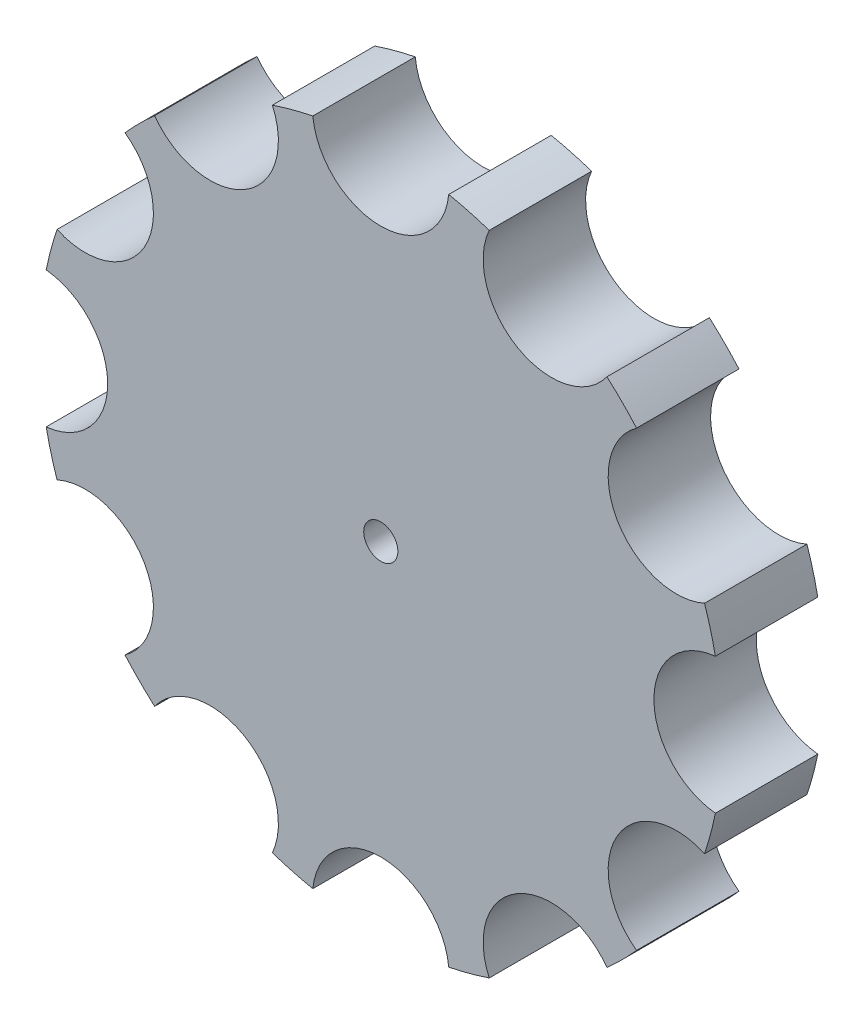
ISO-10303-21;
HEADER;
FILE_DESCRIPTION(('STEP AP214'),'2;1');
FILE_NAME('part.step','',(''),(''),'','','');
FILE_SCHEMA(('AUTOMOTIVE_DESIGN { 1 0 10303 214 1 1 1 1 }'));
ENDSEC;
DATA;
#1=APPLICATION_CONTEXT('core data for automotive mechanical design processes');
#2=APPLICATION_PROTOCOL_DEFINITION('international standard','automotive_design',2000,#1);
#3=PRODUCT_CONTEXT('',#1,'mechanical');
#4=PRODUCT('Part','Part','',(#3));
#5=PRODUCT_RELATED_PRODUCT_CATEGORY('part','',(#4));
#6=PRODUCT_DEFINITION_FORMATION('','',#4);
#7=PRODUCT_DEFINITION_CONTEXT('part definition',#1,'design');
#8=PRODUCT_DEFINITION('design','',#6,#7);
#9=PRODUCT_DEFINITION_SHAPE('','',#8);
#10=(LENGTH_UNIT() NAMED_UNIT(*) SI_UNIT(.MILLI.,.METRE.));
#11=(NAMED_UNIT(*) PLANE_ANGLE_UNIT() SI_UNIT($,.RADIAN.));
#12=(NAMED_UNIT(*) SI_UNIT($,.STERADIAN.) SOLID_ANGLE_UNIT());
#13=UNCERTAINTY_MEASURE_WITH_UNIT(LENGTH_MEASURE(1.E-05),#10,'distance_accuracy_value','');
#14=(GEOMETRIC_REPRESENTATION_CONTEXT(3) GLOBAL_UNCERTAINTY_ASSIGNED_CONTEXT((#13)) GLOBAL_UNIT_ASSIGNED_CONTEXT((#10,
#11,#12)) REPRESENTATION_CONTEXT('',''));
#15=CARTESIAN_POINT('',(0.,0.,0.));
#16=DIRECTION('',(0.,0.,1.));
#17=DIRECTION('',(1.,0.,0.));
#18=AXIS2_PLACEMENT_3D('',#15,#16,#17);
#19=CARTESIAN_POINT('',(-24.9999999999997,43.3012701892209,15.));
#20=DIRECTION('',(0.,0.,-1.));
#21=DIRECTION('',(-1.,0.,0.));
#22=AXIS2_PLACEMENT_3D('',#19,#20,#21);
#23=CYLINDRICAL_SURFACE('',#22,10.0034017647237);
#24=CARTESIAN_POINT('',(-24.9999999999997,43.3012701892209,0.));
#25=DIRECTION('',(0.,0.,1.));
#26=DIRECTION('',(1.,0.,0.));
#27=AXIS2_PLACEMENT_3D('',#24,#25,#26);
#28=CIRCLE('',#27,10.0034017647237);
#29=CARTESIAN_POINT('',(-33.1194053593373,37.4580430434359,0.));
#30=VERTEX_POINT('',#29);
#31=CARTESIAN_POINT('',(-15.8799141719984,47.4112679211384,0.));
#32=VERTEX_POINT('',#31);
#33=EDGE_CURVE('E239',#30,#32,#28,.T.);
#34=ORIENTED_EDGE('',*,*,#33,.F.);
#35=DIRECTION('',(0.,0.,-1.));
#36=VECTOR('',#35,1.);
#37=CARTESIAN_POINT('',(-33.1194053593373,37.4580430434359,15.));
#38=LINE('',#37,#36);
#39=CARTESIAN_POINT('',(-33.1194053593373,37.4580430434359,15.));
#40=VERTEX_POINT('',#39);
#41=EDGE_CURVE('E11',#40,#30,#38,.T.);
#42=ORIENTED_EDGE('',*,*,#41,.F.);
#43=CARTESIAN_POINT('',(-24.9999999999997,43.3012701892209,15.));
#44=DIRECTION('',(0.,0.,1.));
#45=DIRECTION('',(1.,0.,0.));
#46=AXIS2_PLACEMENT_3D('',#43,#44,#45);
#47=CIRCLE('',#46,10.0034017647237);
#48=CARTESIAN_POINT('',(-15.8799141719984,47.4112679211384,15.));
#49=VERTEX_POINT('',#48);
#50=EDGE_CURVE('E332',#40,#49,#47,.T.);
#51=ORIENTED_EDGE('',*,*,#50,.T.);
#52=DIRECTION('',(0.,0.,-1.));
#53=VECTOR('',#52,1.);
#54=CARTESIAN_POINT('',(-15.8799141719984,47.4112679211384,15.));
#55=LINE('',#54,#53);
#56=EDGE_CURVE('E144',#49,#32,#55,.T.);
#57=ORIENTED_EDGE('',*,*,#56,.T.);
#58=EDGE_LOOP('',(#34,#42,#51,#57));
#59=FACE_BOUND('',#58,.T.);
#60=ADVANCED_FACE('F45',(#59),#23,.F.);
#61=CARTESIAN_POINT('',(0.,0.,15.));
#62=DIRECTION('',(0.,0.,-1.));
#63=DIRECTION('',(-1.,0.,0.));
#64=AXIS2_PLACEMENT_3D('',#61,#62,#63);
#65=CYLINDRICAL_SURFACE('',#64,50.);
#66=CARTESIAN_POINT('',(0.,0.,0.));
#67=DIRECTION('',(0.,0.,1.));
#68=DIRECTION('',(1.,0.,0.));
#69=AXIS2_PLACEMENT_3D('',#66,#67,#68);
#70=CIRCLE('',#69,50.);
#71=CARTESIAN_POINT('',(-37.4580430434362,33.119405359337,0.));
#72=VERTEX_POINT('',#71);
#73=EDGE_CURVE('E243',#30,#72,#70,.T.);
#74=ORIENTED_EDGE('',*,*,#73,.T.);
#75=DIRECTION('',(0.,0.,-1.));
#76=VECTOR('',#75,1.);
#77=CARTESIAN_POINT('',(-37.4580430434362,33.119405359337,15.));
#78=LINE('',#77,#76);
#79=CARTESIAN_POINT('',(-37.4580430434362,33.119405359337,15.));
#80=VERTEX_POINT('',#79);
#81=EDGE_CURVE('E54',#80,#72,#78,.T.);
#82=ORIENTED_EDGE('',*,*,#81,.F.);
#83=CARTESIAN_POINT('',(0.,0.,15.));
#84=DIRECTION('',(0.,0.,1.));
#85=DIRECTION('',(1.,0.,0.));
#86=AXIS2_PLACEMENT_3D('',#83,#84,#85);
#87=CIRCLE('',#86,50.);
#88=EDGE_CURVE('E418',#40,#80,#87,.T.);
#89=ORIENTED_EDGE('',*,*,#88,.F.);
#90=ORIENTED_EDGE('',*,*,#41,.T.);
#91=EDGE_LOOP('',(#74,#82,#89,#90));
#92=FACE_BOUND('',#91,.T.);
#93=ADVANCED_FACE('F402',(#92),#65,.T.);
#94=CARTESIAN_POINT('',(-43.3012701892209,24.9999999999981,15.));
#95=DIRECTION('',(0.,0.,-1.));
#96=DIRECTION('',(-1.,0.,0.));
#97=AXIS2_PLACEMENT_3D('',#94,#95,#96);
#98=CYLINDRICAL_SURFACE('',#97,10.0034017647246);
#99=CARTESIAN_POINT('',(-43.3012701892209,24.9999999999981,0.));
#100=DIRECTION('',(0.,0.,1.));
#101=DIRECTION('',(1.,0.,0.));
#102=AXIS2_PLACEMENT_3D('',#99,#100,#101);
#103=CIRCLE('',#102,10.0034017647246);
#104=CARTESIAN_POINT('',(-47.4112679211391,15.8799141719961,0.));
#105=VERTEX_POINT('',#104);
#106=EDGE_CURVE('E248',#105,#72,#103,.T.);
#107=ORIENTED_EDGE('',*,*,#106,.F.);
#108=DIRECTION('',(0.,0.,-1.));
#109=VECTOR('',#108,1.);
#110=CARTESIAN_POINT('',(-47.4112679211391,15.8799141719961,15.));
#111=LINE('',#110,#109);
#112=CARTESIAN_POINT('',(-47.4112679211391,15.8799141719961,15.));
#113=VERTEX_POINT('',#112);
#114=EDGE_CURVE('E390',#113,#105,#111,.T.);
#115=ORIENTED_EDGE('',*,*,#114,.F.);
#116=CARTESIAN_POINT('',(-43.3012701892209,24.9999999999981,15.));
#117=DIRECTION('',(0.,0.,1.));
#118=DIRECTION('',(1.,0.,0.));
#119=AXIS2_PLACEMENT_3D('',#116,#117,#118);
#120=CIRCLE('',#119,10.0034017647246);
#121=EDGE_CURVE('E399',#113,#80,#120,.T.);
#122=ORIENTED_EDGE('',*,*,#121,.T.);
#123=ORIENTED_EDGE('',*,*,#81,.T.);
#124=EDGE_LOOP('',(#107,#115,#122,#123));
#125=FACE_BOUND('',#124,.T.);
#126=ADVANCED_FACE('F397',(#125),#98,.F.);
#127=CARTESIAN_POINT('',(0.,0.,15.));
#128=DIRECTION('',(0.,0.,-1.));
#129=DIRECTION('',(-1.,0.,0.));
#130=AXIS2_PLACEMENT_3D('',#127,#128,#129);
#131=CYLINDRICAL_SURFACE('',#130,50.);
#132=CARTESIAN_POINT('',(0.,0.,0.));
#133=DIRECTION('',(0.,0.,1.));
#134=DIRECTION('',(1.,0.,0.));
#135=AXIS2_PLACEMENT_3D('',#132,#133,#134);
#136=CIRCLE('',#135,50.);
#137=CARTESIAN_POINT('',(-48.9993195313352,9.95322487770228,0.));
#138=VERTEX_POINT('',#137);
#139=EDGE_CURVE('E252',#105,#138,#136,.T.);
#140=ORIENTED_EDGE('',*,*,#139,.T.);
#141=DIRECTION('',(0.,0.,-1.));
#142=VECTOR('',#141,1.);
#143=CARTESIAN_POINT('',(-48.9993195313352,9.95322487770228,15.));
#144=LINE('',#143,#142);
#145=CARTESIAN_POINT('',(-48.9993195313352,9.95322487770228,15.));
#146=VERTEX_POINT('',#145);
#147=EDGE_CURVE('E387',#146,#138,#144,.T.);
#148=ORIENTED_EDGE('',*,*,#147,.F.);
#149=CARTESIAN_POINT('',(0.,0.,15.));
#150=DIRECTION('',(0.,0.,1.));
#151=DIRECTION('',(1.,0.,0.));
#152=AXIS2_PLACEMENT_3D('',#149,#150,#151);
#153=CIRCLE('',#152,50.);
#154=EDGE_CURVE('E413',#113,#146,#153,.T.);
#155=ORIENTED_EDGE('',*,*,#154,.F.);
#156=ORIENTED_EDGE('',*,*,#114,.T.);
#157=EDGE_LOOP('',(#140,#148,#155,#156));
#158=FACE_BOUND('',#157,.T.);
#159=ADVANCED_FACE('F410',(#158),#131,.T.);
#160=CARTESIAN_POINT('',(-49.9999999999979,-2.12856659028243E-12,15.));
#161=DIRECTION('',(0.,0.,-1.));
#162=DIRECTION('',(-1.,0.,0.));
#163=AXIS2_PLACEMENT_3D('',#160,#161,#162);
#164=CYLINDRICAL_SURFACE('',#163,10.0034017647256);
#165=CARTESIAN_POINT('',(-49.9999999999979,-2.12856659028243E-12,0.));
#166=DIRECTION('',(0.,0.,1.));
#167=DIRECTION('',(1.,0.,0.));
#168=AXIS2_PLACEMENT_3D('',#165,#166,#167);
#169=CIRCLE('',#168,10.0034017647256);
#170=CARTESIAN_POINT('',(-48.9993195313344,-9.95322487770645,0.));
#171=VERTEX_POINT('',#170);
#172=EDGE_CURVE('E256',#171,#138,#169,.T.);
#173=ORIENTED_EDGE('',*,*,#172,.F.);
#174=DIRECTION('',(0.,0.,-1.));
#175=VECTOR('',#174,1.);
#176=CARTESIAN_POINT('',(-48.9993195313344,-9.95322487770645,15.));
#177=LINE('',#176,#175);
#178=CARTESIAN_POINT('',(-48.9993195313344,-9.95322487770645,15.));
#179=VERTEX_POINT('',#178);
#180=EDGE_CURVE('E384',#179,#171,#177,.T.);
#181=ORIENTED_EDGE('',*,*,#180,.F.);
#182=CARTESIAN_POINT('',(-49.9999999999979,-2.12856659028243E-12,15.));
#183=DIRECTION('',(0.,0.,1.));
#184=DIRECTION('',(1.,0.,0.));
#185=AXIS2_PLACEMENT_3D('',#182,#183,#184);
#186=CIRCLE('',#185,10.0034017647256);
#187=EDGE_CURVE('E416',#179,#146,#186,.T.);
#188=ORIENTED_EDGE('',*,*,#187,.T.);
#189=ORIENTED_EDGE('',*,*,#147,.T.);
#190=EDGE_LOOP('',(#173,#181,#188,#189));
#191=FACE_BOUND('',#190,.T.);
#192=ADVANCED_FACE('F520',(#191),#164,.F.);
#193=CARTESIAN_POINT('',(0.,0.,15.));
#194=DIRECTION('',(0.,0.,-1.));
#195=DIRECTION('',(-1.,0.,0.));
#196=AXIS2_PLACEMENT_3D('',#193,#194,#195);
#197=CYLINDRICAL_SURFACE('',#196,50.);
#198=CARTESIAN_POINT('',(0.,0.,0.));
#199=DIRECTION('',(0.,0.,1.));
#200=DIRECTION('',(1.,0.,0.));
#201=AXIS2_PLACEMENT_3D('',#198,#199,#200);
#202=CIRCLE('',#201,50.);
#203=CARTESIAN_POINT('',(-47.4112679211384,-15.8799141719984,0.));
#204=VERTEX_POINT('',#203);
#205=EDGE_CURVE('E260',#171,#204,#202,.T.);
#206=ORIENTED_EDGE('',*,*,#205,.T.);
#207=DIRECTION('',(0.,0.,-1.));
#208=VECTOR('',#207,1.);
#209=CARTESIAN_POINT('',(-47.4112679211384,-15.8799141719984,15.));
#210=LINE('',#209,#208);
#211=CARTESIAN_POINT('',(-47.4112679211384,-15.8799141719984,15.));
#212=VERTEX_POINT('',#211);
#213=EDGE_CURVE('E381',#212,#204,#210,.T.);
#214=ORIENTED_EDGE('',*,*,#213,.F.);
#215=CARTESIAN_POINT('',(0.,0.,15.));
#216=DIRECTION('',(0.,0.,1.));
#217=DIRECTION('',(1.,0.,0.));
#218=AXIS2_PLACEMENT_3D('',#215,#216,#217);
#219=CIRCLE('',#218,50.);
#220=EDGE_CURVE('E427',#179,#212,#219,.T.);
#221=ORIENTED_EDGE('',*,*,#220,.F.);
#222=ORIENTED_EDGE('',*,*,#180,.T.);
#223=EDGE_LOOP('',(#206,#214,#221,#222));
#224=FACE_BOUND('',#223,.T.);
#225=ADVANCED_FACE('F523',(#224),#197,.T.);
#226=CARTESIAN_POINT('',(-43.3012701892187,-25.0000000000019,15.));
#227=DIRECTION('',(0.,0.,-1.));
#228=DIRECTION('',(-1.,0.,0.));
#229=AXIS2_PLACEMENT_3D('',#226,#227,#228);
#230=CYLINDRICAL_SURFACE('',#229,10.0034017647265);
#231=CARTESIAN_POINT('',(-43.3012701892187,-25.0000000000019,0.));
#232=DIRECTION('',(0.,0.,1.));
#233=DIRECTION('',(1.,0.,0.));
#234=AXIS2_PLACEMENT_3D('',#231,#232,#233);
#235=CIRCLE('',#234,10.0034017647265);
#236=CARTESIAN_POINT('',(-37.4580430434321,-33.1194053593416,0.));
#237=VERTEX_POINT('',#236);
#238=EDGE_CURVE('E264',#237,#204,#235,.T.);
#239=ORIENTED_EDGE('',*,*,#238,.F.);
#240=DIRECTION('',(0.,0.,-1.));
#241=VECTOR('',#240,1.);
#242=CARTESIAN_POINT('',(-37.4580430434321,-33.1194053593416,15.));
#243=LINE('',#242,#241);
#244=CARTESIAN_POINT('',(-37.4580430434321,-33.1194053593416,15.));
#245=VERTEX_POINT('',#244);
#246=EDGE_CURVE('E378',#245,#237,#243,.T.);
#247=ORIENTED_EDGE('',*,*,#246,.F.);
#248=CARTESIAN_POINT('',(-43.3012701892187,-25.0000000000019,15.));
#249=DIRECTION('',(0.,0.,1.));
#250=DIRECTION('',(1.,0.,0.));
#251=AXIS2_PLACEMENT_3D('',#248,#249,#250);
#252=CIRCLE('',#251,10.0034017647265);
#253=EDGE_CURVE('E430',#245,#212,#252,.T.);
#254=ORIENTED_EDGE('',*,*,#253,.T.);
#255=ORIENTED_EDGE('',*,*,#213,.T.);
#256=EDGE_LOOP('',(#239,#247,#254,#255));
#257=FACE_BOUND('',#256,.T.);
#258=ADVANCED_FACE('F527',(#257),#230,.F.);
#259=CARTESIAN_POINT('',(0.,0.,15.));
#260=DIRECTION('',(0.,0.,-1.));
#261=DIRECTION('',(-1.,0.,0.));
#262=AXIS2_PLACEMENT_3D('',#259,#260,#261);
#263=CYLINDRICAL_SURFACE('',#262,50.);
#264=CARTESIAN_POINT('',(0.,0.,0.));
#265=DIRECTION('',(0.,0.,1.));
#266=DIRECTION('',(1.,0.,0.));
#267=AXIS2_PLACEMENT_3D('',#264,#265,#266);
#268=CIRCLE('',#267,50.);
#269=CARTESIAN_POINT('',(-33.1194053593366,-37.4580430434366,0.));
#270=VERTEX_POINT('',#269);
#271=EDGE_CURVE('E268',#237,#270,#268,.T.);
#272=ORIENTED_EDGE('',*,*,#271,.T.);
#273=DIRECTION('',(0.,0.,-1.));
#274=VECTOR('',#273,1.);
#275=CARTESIAN_POINT('',(-33.1194053593366,-37.4580430434366,15.));
#276=LINE('',#275,#274);
#277=CARTESIAN_POINT('',(-33.1194053593366,-37.4580430434366,15.));
#278=VERTEX_POINT('',#277);
#279=EDGE_CURVE('E375',#278,#270,#276,.T.);
#280=ORIENTED_EDGE('',*,*,#279,.F.);
#281=CARTESIAN_POINT('',(0.,0.,15.));
#282=DIRECTION('',(0.,0.,1.));
#283=DIRECTION('',(1.,0.,0.));
#284=AXIS2_PLACEMENT_3D('',#281,#282,#283);
#285=CIRCLE('',#284,50.);
#286=EDGE_CURVE('E434',#245,#278,#285,.T.);
#287=ORIENTED_EDGE('',*,*,#286,.F.);
#288=ORIENTED_EDGE('',*,*,#246,.T.);
#289=EDGE_LOOP('',(#272,#280,#287,#288));
#290=FACE_BOUND('',#289,.T.);
#291=ADVANCED_FACE('F531',(#290),#263,.T.);
#292=CARTESIAN_POINT('',(-24.999999999996,-43.301270189223,15.));
#293=DIRECTION('',(0.,0.,-1.));
#294=DIRECTION('',(-1.,0.,0.));
#295=AXIS2_PLACEMENT_3D('',#292,#293,#294);
#296=CYLINDRICAL_SURFACE('',#295,10.003401764727);
#297=CARTESIAN_POINT('',(-24.999999999996,-43.301270189223,0.));
#298=DIRECTION('',(0.,0.,1.));
#299=DIRECTION('',(1.,0.,0.));
#300=AXIS2_PLACEMENT_3D('',#297,#298,#299);
#301=CIRCLE('',#300,10.003401764727);
#302=CARTESIAN_POINT('',(-15.8799141719912,-47.4112679211408,0.));
#303=VERTEX_POINT('',#302);
#304=EDGE_CURVE('E272',#303,#270,#301,.T.);
#305=ORIENTED_EDGE('',*,*,#304,.F.);
#306=DIRECTION('',(0.,0.,-1.));
#307=VECTOR('',#306,1.);
#308=CARTESIAN_POINT('',(-15.8799141719912,-47.4112679211408,15.));
#309=LINE('',#308,#307);
#310=CARTESIAN_POINT('',(-15.8799141719912,-47.4112679211408,15.));
#311=VERTEX_POINT('',#310);
#312=EDGE_CURVE('E372',#311,#303,#309,.T.);
#313=ORIENTED_EDGE('',*,*,#312,.F.);
#314=CARTESIAN_POINT('',(-24.999999999996,-43.301270189223,15.));
#315=DIRECTION('',(0.,0.,1.));
#316=DIRECTION('',(1.,0.,0.));
#317=AXIS2_PLACEMENT_3D('',#314,#315,#316);
#318=CIRCLE('',#317,10.003401764727);
#319=EDGE_CURVE('E437',#311,#278,#318,.T.);
#320=ORIENTED_EDGE('',*,*,#319,.T.);
#321=ORIENTED_EDGE('',*,*,#279,.T.);
#322=EDGE_LOOP('',(#305,#313,#320,#321));
#323=FACE_BOUND('',#322,.T.);
#324=ADVANCED_FACE('F535',(#323),#296,.F.);
#325=CARTESIAN_POINT('',(0.,0.,15.));
#326=DIRECTION('',(0.,0.,-1.));
#327=DIRECTION('',(-1.,0.,0.));
#328=AXIS2_PLACEMENT_3D('',#325,#326,#327);
#329=CYLINDRICAL_SURFACE('',#328,50.);
#330=CARTESIAN_POINT('',(0.,0.,0.));
#331=DIRECTION('',(0.,0.,1.));
#332=DIRECTION('',(1.,0.,0.));
#333=AXIS2_PLACEMENT_3D('',#330,#331,#332);
#334=CIRCLE('',#333,50.);
#335=CARTESIAN_POINT('',(-9.95322487770119,-48.9993195313354,0.));
#336=VERTEX_POINT('',#335);
#337=EDGE_CURVE('E276',#303,#336,#334,.T.);
#338=ORIENTED_EDGE('',*,*,#337,.T.);
#339=DIRECTION('',(0.,0.,-1.));
#340=VECTOR('',#339,1.);
#341=CARTESIAN_POINT('',(-9.95322487770119,-48.9993195313354,15.));
#342=LINE('',#341,#340);
#343=CARTESIAN_POINT('',(-9.95322487770119,-48.9993195313354,15.));
#344=VERTEX_POINT('',#343);
#345=EDGE_CURVE('E369',#344,#336,#342,.T.);
#346=ORIENTED_EDGE('',*,*,#345,.F.);
#347=CARTESIAN_POINT('',(0.,0.,15.));
#348=DIRECTION('',(0.,0.,1.));
#349=DIRECTION('',(1.,0.,0.));
#350=AXIS2_PLACEMENT_3D('',#347,#348,#349);
#351=CIRCLE('',#350,50.);
#352=EDGE_CURVE('E441',#311,#344,#351,.T.);
#353=ORIENTED_EDGE('',*,*,#352,.F.);
#354=ORIENTED_EDGE('',*,*,#312,.T.);
#355=EDGE_LOOP('',(#338,#346,#353,#354));
#356=FACE_BOUND('',#355,.T.);
#357=ADVANCED_FACE('F539',(#356),#329,.T.);
#358=CARTESIAN_POINT('',(4.24488671257339E-12,-50.,15.));
#359=DIRECTION('',(0.,0.,-1.));
#360=DIRECTION('',(-1.,0.,0.));
#361=AXIS2_PLACEMENT_3D('',#358,#359,#360);
#362=CYLINDRICAL_SURFACE('',#361,10.0034017647269);
#363=CARTESIAN_POINT('',(4.24488671257339E-12,-50.,0.));
#364=DIRECTION('',(0.,0.,1.));
#365=DIRECTION('',(1.,0.,0.));
#366=AXIS2_PLACEMENT_3D('',#363,#364,#365);
#367=CIRCLE('',#366,10.0034017647269);
#368=CARTESIAN_POINT('',(9.95322487770951,-48.9993195313337,0.));
#369=VERTEX_POINT('',#368);
#370=EDGE_CURVE('E280',#369,#336,#367,.T.);
#371=ORIENTED_EDGE('',*,*,#370,.F.);
#372=DIRECTION('',(0.,0.,-1.));
#373=VECTOR('',#372,1.);
#374=CARTESIAN_POINT('',(9.95322487770951,-48.9993195313337,15.));
#375=LINE('',#374,#373);
#376=CARTESIAN_POINT('',(9.95322487770951,-48.9993195313337,15.));
#377=VERTEX_POINT('',#376);
#378=EDGE_CURVE('E366',#377,#369,#375,.T.);
#379=ORIENTED_EDGE('',*,*,#378,.F.);
#380=CARTESIAN_POINT('',(4.24488671257339E-12,-50.,15.));
#381=DIRECTION('',(0.,0.,1.));
#382=DIRECTION('',(1.,0.,0.));
#383=AXIS2_PLACEMENT_3D('',#380,#381,#382);
#384=CIRCLE('',#383,10.0034017647269);
#385=EDGE_CURVE('E444',#377,#344,#384,.T.);
#386=ORIENTED_EDGE('',*,*,#385,.T.);
#387=ORIENTED_EDGE('',*,*,#345,.T.);
#388=EDGE_LOOP('',(#371,#379,#386,#387));
#389=FACE_BOUND('',#388,.T.);
#390=ADVANCED_FACE('F543',(#389),#362,.F.);
#391=CARTESIAN_POINT('',(0.,0.,15.));
#392=DIRECTION('',(0.,0.,-1.));
#393=DIRECTION('',(-1.,0.,0.));
#394=AXIS2_PLACEMENT_3D('',#391,#392,#393);
#395=CYLINDRICAL_SURFACE('',#394,50.);
#396=CARTESIAN_POINT('',(0.,0.,0.));
#397=DIRECTION('',(0.,0.,1.));
#398=DIRECTION('',(1.,0.,0.));
#399=AXIS2_PLACEMENT_3D('',#396,#397,#398);
#400=CIRCLE('',#399,50.);
#401=CARTESIAN_POINT('',(15.8799141719997,-47.4112679211379,0.));
#402=VERTEX_POINT('',#401);
#403=EDGE_CURVE('E284',#369,#402,#400,.T.);
#404=ORIENTED_EDGE('',*,*,#403,.T.);
#405=DIRECTION('',(0.,0.,-1.));
#406=VECTOR('',#405,1.);
#407=CARTESIAN_POINT('',(15.8799141719997,-47.4112679211379,15.));
#408=LINE('',#407,#406);
#409=CARTESIAN_POINT('',(15.8799141719997,-47.4112679211379,15.));
#410=VERTEX_POINT('',#409);
#411=EDGE_CURVE('E363',#410,#402,#408,.T.);
#412=ORIENTED_EDGE('',*,*,#411,.F.);
#413=CARTESIAN_POINT('',(0.,0.,15.));
#414=DIRECTION('',(0.,0.,1.));
#415=DIRECTION('',(1.,0.,0.));
#416=AXIS2_PLACEMENT_3D('',#413,#414,#415);
#417=CIRCLE('',#416,50.);
#418=EDGE_CURVE('E448',#377,#410,#417,.T.);
#419=ORIENTED_EDGE('',*,*,#418,.F.);
#420=ORIENTED_EDGE('',*,*,#378,.T.);
#421=EDGE_LOOP('',(#404,#412,#419,#420));
#422=FACE_BOUND('',#421,.T.);
#423=ADVANCED_FACE('F547',(#422),#395,.T.);
#424=CARTESIAN_POINT('',(25.000000000004,-43.3012701892209,15.));
#425=DIRECTION('',(0.,0.,-1.));
#426=DIRECTION('',(-1.,0.,0.));
#427=AXIS2_PLACEMENT_3D('',#424,#425,#426);
#428=CYLINDRICAL_SURFACE('',#427,10.0034017647263);
#429=CARTESIAN_POINT('',(25.000000000004,-43.3012701892209,0.));
#430=DIRECTION('',(0.,0.,1.));
#431=DIRECTION('',(1.,0.,0.));
#432=AXIS2_PLACEMENT_3D('',#429,#430,#431);
#433=CIRCLE('',#432,10.0034017647263);
#434=CARTESIAN_POINT('',(33.1194053593418,-37.4580430434319,0.));
#435=VERTEX_POINT('',#434);
#436=EDGE_CURVE('E288',#435,#402,#433,.T.);
#437=ORIENTED_EDGE('',*,*,#436,.F.);
#438=DIRECTION('',(0.,0.,-1.));
#439=VECTOR('',#438,1.);
#440=CARTESIAN_POINT('',(33.1194053593418,-37.4580430434319,15.));
#441=LINE('',#440,#439);
#442=CARTESIAN_POINT('',(33.1194053593418,-37.4580430434319,15.));
#443=VERTEX_POINT('',#442);
#444=EDGE_CURVE('E360',#443,#435,#441,.T.);
#445=ORIENTED_EDGE('',*,*,#444,.F.);
#446=CARTESIAN_POINT('',(25.000000000004,-43.3012701892209,15.));
#447=DIRECTION('',(0.,0.,1.));
#448=DIRECTION('',(1.,0.,0.));
#449=AXIS2_PLACEMENT_3D('',#446,#447,#448);
#450=CIRCLE('',#449,10.0034017647263);
#451=EDGE_CURVE('E451',#443,#410,#450,.T.);
#452=ORIENTED_EDGE('',*,*,#451,.T.);
#453=ORIENTED_EDGE('',*,*,#411,.T.);
#454=EDGE_LOOP('',(#437,#445,#452,#453));
#455=FACE_BOUND('',#454,.T.);
#456=ADVANCED_FACE('F551',(#455),#428,.F.);
#457=CARTESIAN_POINT('',(0.,0.,15.));
#458=DIRECTION('',(0.,0.,-1.));
#459=DIRECTION('',(-1.,0.,0.));
#460=AXIS2_PLACEMENT_3D('',#457,#458,#459);
#461=CYLINDRICAL_SURFACE('',#460,50.);
#462=CARTESIAN_POINT('',(0.,0.,0.));
#463=DIRECTION('',(0.,0.,1.));
#464=DIRECTION('',(1.,0.,0.));
#465=AXIS2_PLACEMENT_3D('',#462,#463,#464);
#466=CIRCLE('',#465,50.);
#467=CARTESIAN_POINT('',(37.4580430434374,-33.1194053593356,0.));
#468=VERTEX_POINT('',#467);
#469=EDGE_CURVE('E292',#435,#468,#466,.T.);
#470=ORIENTED_EDGE('',*,*,#469,.T.);
#471=DIRECTION('',(0.,0.,-1.));
#472=VECTOR('',#471,1.);
#473=CARTESIAN_POINT('',(37.4580430434374,-33.1194053593356,15.));
#474=LINE('',#473,#472);
#475=CARTESIAN_POINT('',(37.4580430434374,-33.1194053593356,15.));
#476=VERTEX_POINT('',#475);
#477=EDGE_CURVE('E357',#476,#468,#474,.T.);
#478=ORIENTED_EDGE('',*,*,#477,.F.);
#479=CARTESIAN_POINT('',(0.,0.,15.));
#480=DIRECTION('',(0.,0.,1.));
#481=DIRECTION('',(1.,0.,0.));
#482=AXIS2_PLACEMENT_3D('',#479,#480,#481);
#483=CIRCLE('',#482,50.);
#484=EDGE_CURVE('E455',#443,#476,#483,.T.);
#485=ORIENTED_EDGE('',*,*,#484,.F.);
#486=ORIENTED_EDGE('',*,*,#444,.T.);
#487=EDGE_LOOP('',(#470,#478,#485,#486));
#488=FACE_BOUND('',#487,.T.);
#489=ADVANCED_FACE('F555',(#488),#461,.T.);
#490=CARTESIAN_POINT('',(43.3012701892251,-24.9999999999982,15.));
#491=DIRECTION('',(0.,0.,-1.));
#492=DIRECTION('',(-1.,0.,0.));
#493=AXIS2_PLACEMENT_3D('',#490,#491,#492);
#494=CYLINDRICAL_SURFACE('',#493,10.0034017647252);
#495=CARTESIAN_POINT('',(43.3012701892251,-24.9999999999982,0.));
#496=DIRECTION('',(0.,0.,1.));
#497=DIRECTION('',(1.,0.,0.));
#498=AXIS2_PLACEMENT_3D('',#495,#496,#497);
#499=CIRCLE('',#498,10.0034017647252);
#500=CARTESIAN_POINT('',(47.4112679211399,-15.8799141719939,0.));
#501=VERTEX_POINT('',#500);
#502=EDGE_CURVE('E296',#501,#468,#499,.T.);
#503=ORIENTED_EDGE('',*,*,#502,.F.);
#504=DIRECTION('',(0.,0.,-1.));
#505=VECTOR('',#504,1.);
#506=CARTESIAN_POINT('',(47.4112679211399,-15.8799141719939,15.));
#507=LINE('',#506,#505);
#508=CARTESIAN_POINT('',(47.4112679211399,-15.8799141719939,15.));
#509=VERTEX_POINT('',#508);
#510=EDGE_CURVE('E354',#509,#501,#507,.T.);
#511=ORIENTED_EDGE('',*,*,#510,.F.);
#512=CARTESIAN_POINT('',(43.3012701892251,-24.9999999999982,15.));
#513=DIRECTION('',(0.,0.,1.));
#514=DIRECTION('',(1.,0.,0.));
#515=AXIS2_PLACEMENT_3D('',#512,#513,#514);
#516=CIRCLE('',#515,10.0034017647252);
#517=EDGE_CURVE('E458',#509,#476,#516,.T.);
#518=ORIENTED_EDGE('',*,*,#517,.T.);
#519=ORIENTED_EDGE('',*,*,#477,.T.);
#520=EDGE_LOOP('',(#503,#511,#518,#519));
#521=FACE_BOUND('',#520,.T.);
#522=ADVANCED_FACE('F559',(#521),#494,.F.);
#523=CARTESIAN_POINT('',(0.,0.,15.));
#524=DIRECTION('',(0.,0.,-1.));
#525=DIRECTION('',(-1.,0.,0.));
#526=AXIS2_PLACEMENT_3D('',#523,#524,#525);
#527=CYLINDRICAL_SURFACE('',#526,50.);
#528=CARTESIAN_POINT('',(0.,0.,0.));
#529=DIRECTION('',(0.,0.,1.));
#530=DIRECTION('',(1.,0.,0.));
#531=AXIS2_PLACEMENT_3D('',#528,#529,#530);
#532=CIRCLE('',#531,50.);
#533=CARTESIAN_POINT('',(48.9993195313356,-9.9532248777003,0.));
#534=VERTEX_POINT('',#533);
#535=EDGE_CURVE('E300',#501,#534,#532,.T.);
#536=ORIENTED_EDGE('',*,*,#535,.T.);
#537=DIRECTION('',(0.,0.,-1.));
#538=VECTOR('',#537,1.);
#539=CARTESIAN_POINT('',(48.9993195313356,-9.9532248777003,15.));
#540=LINE('',#539,#538);
#541=CARTESIAN_POINT('',(48.9993195313356,-9.9532248777003,15.));
#542=VERTEX_POINT('',#541);
#543=EDGE_CURVE('E351',#542,#534,#540,.T.);
#544=ORIENTED_EDGE('',*,*,#543,.F.);
#545=CARTESIAN_POINT('',(0.,0.,15.));
#546=DIRECTION('',(0.,0.,1.));
#547=DIRECTION('',(1.,0.,0.));
#548=AXIS2_PLACEMENT_3D('',#545,#546,#547);
#549=CIRCLE('',#548,50.);
#550=EDGE_CURVE('E462',#509,#542,#549,.T.);
#551=ORIENTED_EDGE('',*,*,#550,.F.);
#552=ORIENTED_EDGE('',*,*,#510,.T.);
#553=EDGE_LOOP('',(#536,#544,#551,#552));
#554=FACE_BOUND('',#553,.T.);
#555=ADVANCED_FACE('F563',(#554),#527,.T.);
#556=CARTESIAN_POINT('',(50.0000000000021,2.1224433562867E-12,15.));
#557=DIRECTION('',(0.,0.,-1.));
#558=DIRECTION('',(-1.,0.,0.));
#559=AXIS2_PLACEMENT_3D('',#556,#557,#558);
#560=CYLINDRICAL_SURFACE('',#559,10.0034017647241);
#561=CARTESIAN_POINT('',(50.0000000000021,2.1224433562867E-12,0.));
#562=DIRECTION('',(0.,0.,1.));
#563=DIRECTION('',(1.,0.,0.));
#564=AXIS2_PLACEMENT_3D('',#561,#562,#563);
#565=CIRCLE('',#564,10.0034017647241);
#566=CARTESIAN_POINT('',(48.9993195313348,9.95322487770446,0.));
#567=VERTEX_POINT('',#566);
#568=EDGE_CURVE('E304',#567,#534,#565,.T.);
#569=ORIENTED_EDGE('',*,*,#568,.F.);
#570=DIRECTION('',(0.,0.,-1.));
#571=VECTOR('',#570,1.);
#572=CARTESIAN_POINT('',(48.9993195313348,9.95322487770446,15.));
#573=LINE('',#572,#571);
#574=CARTESIAN_POINT('',(48.9993195313348,9.95322487770446,15.));
#575=VERTEX_POINT('',#574);
#576=EDGE_CURVE('E348',#575,#567,#573,.T.);
#577=ORIENTED_EDGE('',*,*,#576,.F.);
#578=CARTESIAN_POINT('',(50.0000000000021,2.1224433562867E-12,15.));
#579=DIRECTION('',(0.,0.,1.));
#580=DIRECTION('',(1.,0.,0.));
#581=AXIS2_PLACEMENT_3D('',#578,#579,#580);
#582=CIRCLE('',#581,10.0034017647241);
#583=EDGE_CURVE('E465',#575,#542,#582,.T.);
#584=ORIENTED_EDGE('',*,*,#583,.T.);
#585=ORIENTED_EDGE('',*,*,#543,.T.);
#586=EDGE_LOOP('',(#569,#577,#584,#585));
#587=FACE_BOUND('',#586,.T.);
#588=ADVANCED_FACE('F567',(#587),#560,.F.);
#589=CARTESIAN_POINT('',(0.,0.,15.));
#590=DIRECTION('',(0.,0.,-1.));
#591=DIRECTION('',(-1.,0.,0.));
#592=AXIS2_PLACEMENT_3D('',#589,#590,#591);
#593=CYLINDRICAL_SURFACE('',#592,50.);
#594=CARTESIAN_POINT('',(0.,0.,0.));
#595=DIRECTION('',(0.,0.,1.));
#596=DIRECTION('',(1.,0.,0.));
#597=AXIS2_PLACEMENT_3D('',#594,#595,#596);
#598=CIRCLE('',#597,50.);
#599=CARTESIAN_POINT('',(47.4112679211378,15.879914172,0.));
#600=VERTEX_POINT('',#599);
#601=EDGE_CURVE('E308',#567,#600,#598,.T.);
#602=ORIENTED_EDGE('',*,*,#601,.T.);
#603=DIRECTION('',(0.,0.,-1.));
#604=VECTOR('',#603,1.);
#605=CARTESIAN_POINT('',(47.4112679211378,15.879914172,15.));
#606=LINE('',#605,#604);
#607=CARTESIAN_POINT('',(47.4112679211378,15.879914172,15.));
#608=VERTEX_POINT('',#607);
#609=EDGE_CURVE('E345',#608,#600,#606,.T.);
#610=ORIENTED_EDGE('',*,*,#609,.F.);
#611=CARTESIAN_POINT('',(0.,0.,15.));
#612=DIRECTION('',(0.,0.,1.));
#613=DIRECTION('',(1.,0.,0.));
#614=AXIS2_PLACEMENT_3D('',#611,#612,#613);
#615=CIRCLE('',#614,50.);
#616=EDGE_CURVE('E469',#575,#608,#615,.T.);
#617=ORIENTED_EDGE('',*,*,#616,.F.);
#618=ORIENTED_EDGE('',*,*,#576,.T.);
#619=EDGE_LOOP('',(#602,#610,#617,#618));
#620=FACE_BOUND('',#619,.T.);
#621=ADVANCED_FACE('F571',(#620),#593,.T.);
#622=CARTESIAN_POINT('',(43.301270189223,25.0000000000018,15.));
#623=DIRECTION('',(0.,0.,-1.));
#624=DIRECTION('',(-1.,0.,0.));
#625=AXIS2_PLACEMENT_3D('',#622,#623,#624);
#626=CYLINDRICAL_SURFACE('',#625,10.0034017647231);
#627=CARTESIAN_POINT('',(43.301270189223,25.0000000000018,0.));
#628=DIRECTION('',(0.,0.,1.));
#629=DIRECTION('',(1.,0.,0.));
#630=AXIS2_PLACEMENT_3D('',#627,#628,#629);
#631=CIRCLE('',#630,10.0034017647231);
#632=CARTESIAN_POINT('',(37.458043043436,33.1194053593372,0.));
#633=VERTEX_POINT('',#632);
#634=EDGE_CURVE('E312',#633,#600,#631,.T.);
#635=ORIENTED_EDGE('',*,*,#634,.F.);
#636=DIRECTION('',(0.,0.,-1.));
#637=VECTOR('',#636,1.);
#638=CARTESIAN_POINT('',(37.458043043436,33.1194053593372,15.));
#639=LINE('',#638,#637);
#640=CARTESIAN_POINT('',(37.458043043436,33.1194053593372,15.));
#641=VERTEX_POINT('',#640);
#642=EDGE_CURVE('E342',#641,#633,#639,.T.);
#643=ORIENTED_EDGE('',*,*,#642,.F.);
#644=CARTESIAN_POINT('',(43.301270189223,25.0000000000018,15.));
#645=DIRECTION('',(0.,0.,1.));
#646=DIRECTION('',(1.,0.,0.));
#647=AXIS2_PLACEMENT_3D('',#644,#645,#646);
#648=CIRCLE('',#647,10.0034017647231);
#649=EDGE_CURVE('E472',#641,#608,#648,.T.);
#650=ORIENTED_EDGE('',*,*,#649,.T.);
#651=ORIENTED_EDGE('',*,*,#609,.T.);
#652=EDGE_LOOP('',(#635,#643,#650,#651));
#653=FACE_BOUND('',#652,.T.);
#654=ADVANCED_FACE('F575',(#653),#626,.F.);
#655=CARTESIAN_POINT('',(0.,0.,15.));
#656=DIRECTION('',(0.,0.,-1.));
#657=DIRECTION('',(-1.,0.,0.));
#658=AXIS2_PLACEMENT_3D('',#655,#656,#657);
#659=CYLINDRICAL_SURFACE('',#658,50.);
#660=CARTESIAN_POINT('',(0.,0.,0.));
#661=DIRECTION('',(0.,0.,1.));
#662=DIRECTION('',(1.,0.,0.));
#663=AXIS2_PLACEMENT_3D('',#660,#661,#662);
#664=CIRCLE('',#663,50.);
#665=CARTESIAN_POINT('',(33.1194053593361,37.458043043437,0.));
#666=VERTEX_POINT('',#665);
#667=EDGE_CURVE('E316',#633,#666,#664,.T.);
#668=ORIENTED_EDGE('',*,*,#667,.T.);
#669=DIRECTION('',(0.,0.,-1.));
#670=VECTOR('',#669,1.);
#671=CARTESIAN_POINT('',(33.1194053593361,37.458043043437,15.));
#672=LINE('',#671,#670);
#673=CARTESIAN_POINT('',(33.1194053593361,37.458043043437,15.));
#674=VERTEX_POINT('',#673);
#675=EDGE_CURVE('E339',#674,#666,#672,.T.);
#676=ORIENTED_EDGE('',*,*,#675,.F.);
#677=CARTESIAN_POINT('',(0.,0.,15.));
#678=DIRECTION('',(0.,0.,1.));
#679=DIRECTION('',(1.,0.,0.));
#680=AXIS2_PLACEMENT_3D('',#677,#678,#679);
#681=CIRCLE('',#680,50.);
#682=EDGE_CURVE('E476',#641,#674,#681,.T.);
#683=ORIENTED_EDGE('',*,*,#682,.F.);
#684=ORIENTED_EDGE('',*,*,#642,.T.);
#685=EDGE_LOOP('',(#668,#676,#683,#684));
#686=FACE_BOUND('',#685,.T.);
#687=ADVANCED_FACE('F579',(#686),#659,.T.);
#688=CARTESIAN_POINT('',(25.,43.3012701892219,15.));
#689=DIRECTION('',(0.,0.,-1.));
#690=DIRECTION('',(-1.,0.,0.));
#691=AXIS2_PLACEMENT_3D('',#688,#689,#690);
#692=CYLINDRICAL_SURFACE('',#691,10.0034017647225);
#693=CARTESIAN_POINT('',(25.,43.3012701892219,0.));
#694=DIRECTION('',(0.,0.,1.));
#695=DIRECTION('',(1.,0.,0.));
#696=AXIS2_PLACEMENT_3D('',#693,#694,#695);
#697=CIRCLE('',#696,10.0034017647225);
#698=CARTESIAN_POINT('',(15.8799141719995,47.411267921138,0.));
#699=VERTEX_POINT('',#698);
#700=EDGE_CURVE('E320',#699,#666,#697,.T.);
#701=ORIENTED_EDGE('',*,*,#700,.F.);
#702=DIRECTION('',(0.,0.,-1.));
#703=VECTOR('',#702,1.);
#704=CARTESIAN_POINT('',(15.8799141719995,47.411267921138,15.));
#705=LINE('',#704,#703);
#706=CARTESIAN_POINT('',(15.8799141719995,47.411267921138,15.));
#707=VERTEX_POINT('',#706);
#708=EDGE_CURVE('E230',#707,#699,#705,.T.);
#709=ORIENTED_EDGE('',*,*,#708,.F.);
#710=CARTESIAN_POINT('',(25.,43.3012701892219,15.));
#711=DIRECTION('',(0.,0.,1.));
#712=DIRECTION('',(1.,0.,0.));
#713=AXIS2_PLACEMENT_3D('',#710,#711,#712);
#714=CIRCLE('',#713,10.0034017647225);
#715=EDGE_CURVE('E217',#707,#674,#714,.T.);
#716=ORIENTED_EDGE('',*,*,#715,.T.);
#717=ORIENTED_EDGE('',*,*,#675,.T.);
#718=EDGE_LOOP('',(#701,#709,#716,#717));
#719=FACE_BOUND('',#718,.T.);
#720=ADVANCED_FACE('F481',(#719),#692,.F.);
#721=CARTESIAN_POINT('',(0.,0.,15.));
#722=DIRECTION('',(0.,0.,-1.));
#723=DIRECTION('',(-1.,0.,0.));
#724=AXIS2_PLACEMENT_3D('',#721,#722,#723);
#725=CYLINDRICAL_SURFACE('',#724,50.);
#726=CARTESIAN_POINT('',(0.,0.,0.));
#727=DIRECTION('',(0.,0.,1.));
#728=DIRECTION('',(1.,0.,0.));
#729=AXIS2_PLACEMENT_3D('',#726,#727,#728);
#730=CIRCLE('',#729,50.);
#731=CARTESIAN_POINT('',(9.95322487770101,48.9993195313355,0.));
#732=VERTEX_POINT('',#731);
#733=EDGE_CURVE('E225',#699,#732,#730,.T.);
#734=ORIENTED_EDGE('',*,*,#733,.T.);
#735=DIRECTION('',(0.,0.,-1.));
#736=VECTOR('',#735,1.);
#737=CARTESIAN_POINT('',(9.95322487770101,48.9993195313355,15.));
#738=LINE('',#737,#736);
#739=CARTESIAN_POINT('',(9.95322487770101,48.9993195313355,15.));
#740=VERTEX_POINT('',#739);
#741=EDGE_CURVE('E222',#740,#732,#738,.T.);
#742=ORIENTED_EDGE('',*,*,#741,.F.);
#743=CARTESIAN_POINT('',(0.,0.,15.));
#744=DIRECTION('',(0.,0.,1.));
#745=DIRECTION('',(1.,0.,0.));
#746=AXIS2_PLACEMENT_3D('',#743,#744,#745);
#747=CIRCLE('',#746,50.);
#748=EDGE_CURVE('E211',#707,#740,#747,.T.);
#749=ORIENTED_EDGE('',*,*,#748,.F.);
#750=ORIENTED_EDGE('',*,*,#708,.T.);
#751=EDGE_LOOP('',(#734,#742,#749,#750));
#752=FACE_BOUND('',#751,.T.);
#753=ADVANCED_FACE('F223',(#752),#725,.T.);
#754=CARTESIAN_POINT('',(0.,50.,15.));
#755=DIRECTION('',(0.,0.,-1.));
#756=DIRECTION('',(-1.,0.,0.));
#757=AXIS2_PLACEMENT_3D('',#754,#755,#756);
#758=CYLINDRICAL_SURFACE('',#757,10.0034017647225);
#759=CARTESIAN_POINT('',(0.,50.,0.));
#760=DIRECTION('',(0.,0.,1.));
#761=DIRECTION('',(1.,0.,0.));
#762=AXIS2_PLACEMENT_3D('',#759,#760,#761);
#763=CIRCLE('',#762,10.0034017647225);
#764=CARTESIAN_POINT('',(-9.95322487770101,48.9993195313355,0.));
#765=VERTEX_POINT('',#764);
#766=EDGE_CURVE('E326',#765,#732,#763,.T.);
#767=ORIENTED_EDGE('',*,*,#766,.F.);
#768=DIRECTION('',(0.,0.,-1.));
#769=VECTOR('',#768,1.);
#770=CARTESIAN_POINT('',(-9.95322487770101,48.9993195313355,15.));
#771=LINE('',#770,#769);
#772=CARTESIAN_POINT('',(-9.95322487770101,48.9993195313355,15.));
#773=VERTEX_POINT('',#772);
#774=EDGE_CURVE('E137',#773,#765,#771,.T.);
#775=ORIENTED_EDGE('',*,*,#774,.F.);
#776=CARTESIAN_POINT('',(0.,50.,15.));
#777=DIRECTION('',(0.,0.,1.));
#778=DIRECTION('',(1.,0.,0.));
#779=AXIS2_PLACEMENT_3D('',#776,#777,#778);
#780=CIRCLE('',#779,10.0034017647225);
#781=EDGE_CURVE('E215',#773,#740,#780,.T.);
#782=ORIENTED_EDGE('',*,*,#781,.T.);
#783=ORIENTED_EDGE('',*,*,#741,.T.);
#784=EDGE_LOOP('',(#767,#775,#782,#783));
#785=FACE_BOUND('',#784,.T.);
#786=ADVANCED_FACE('F232',(#785),#758,.F.);
#787=CARTESIAN_POINT('',(0.,0.,15.));
#788=DIRECTION('',(0.,0.,-1.));
#789=DIRECTION('',(-1.,0.,0.));
#790=AXIS2_PLACEMENT_3D('',#787,#788,#789);
#791=CYLINDRICAL_SURFACE('',#790,50.);
#792=CARTESIAN_POINT('',(0.,0.,0.));
#793=DIRECTION('',(0.,0.,1.));
#794=DIRECTION('',(1.,0.,0.));
#795=AXIS2_PLACEMENT_3D('',#792,#793,#794);
#796=CIRCLE('',#795,50.);
#797=EDGE_CURVE('E329',#765,#32,#796,.T.);
#798=ORIENTED_EDGE('',*,*,#797,.T.);
#799=ORIENTED_EDGE('',*,*,#56,.F.);
#800=CARTESIAN_POINT('',(0.,0.,15.));
#801=DIRECTION('',(0.,0.,1.));
#802=DIRECTION('',(1.,0.,0.));
#803=AXIS2_PLACEMENT_3D('',#800,#801,#802);
#804=CIRCLE('',#803,50.);
#805=EDGE_CURVE('E62',#773,#49,#804,.T.);
#806=ORIENTED_EDGE('',*,*,#805,.F.);
#807=ORIENTED_EDGE('',*,*,#774,.T.);
#808=EDGE_LOOP('',(#798,#799,#806,#807));
#809=FACE_BOUND('',#808,.T.);
#810=ADVANCED_FACE('F484',(#809),#791,.T.);
#811=CARTESIAN_POINT('',(0.,0.,15.));
#812=DIRECTION('',(0.,0.,1.));
#813=DIRECTION('',(1.,0.,0.));
#814=AXIS2_PLACEMENT_3D('',#811,#812,#813);
#815=PLANE('',#814);
#816=CARTESIAN_POINT('',(0.,0.,15.));
#817=DIRECTION('',(0.,0.,-1.));
#818=DIRECTION('',(-1.,0.,0.));
#819=AXIS2_PLACEMENT_3D('',#816,#817,#818);
#820=CIRCLE('',#819,2.5);
#821=CARTESIAN_POINT('',(-2.5,0.,15.));
#822=VERTEX_POINT('',#821);
#823=EDGE_CURVE('E244',#822,#822,#820,.T.);
#824=ORIENTED_EDGE('',*,*,#823,.T.);
#825=EDGE_LOOP('',(#824));
#826=FACE_BOUND('',#825,.T.);
#827=ORIENTED_EDGE('',*,*,#50,.F.);
#828=ORIENTED_EDGE('',*,*,#88,.T.);
#829=ORIENTED_EDGE('',*,*,#121,.F.);
#830=ORIENTED_EDGE('',*,*,#154,.T.);
#831=ORIENTED_EDGE('',*,*,#187,.F.);
#832=ORIENTED_EDGE('',*,*,#220,.T.);
#833=ORIENTED_EDGE('',*,*,#253,.F.);
#834=ORIENTED_EDGE('',*,*,#286,.T.);
#835=ORIENTED_EDGE('',*,*,#319,.F.);
#836=ORIENTED_EDGE('',*,*,#352,.T.);
#837=ORIENTED_EDGE('',*,*,#385,.F.);
#838=ORIENTED_EDGE('',*,*,#418,.T.);
#839=ORIENTED_EDGE('',*,*,#451,.F.);
#840=ORIENTED_EDGE('',*,*,#484,.T.);
#841=ORIENTED_EDGE('',*,*,#517,.F.);
#842=ORIENTED_EDGE('',*,*,#550,.T.);
#843=ORIENTED_EDGE('',*,*,#583,.F.);
#844=ORIENTED_EDGE('',*,*,#616,.T.);
#845=ORIENTED_EDGE('',*,*,#649,.F.);
#846=ORIENTED_EDGE('',*,*,#682,.T.);
#847=ORIENTED_EDGE('',*,*,#715,.F.);
#848=ORIENTED_EDGE('',*,*,#748,.T.);
#849=ORIENTED_EDGE('',*,*,#781,.F.);
#850=ORIENTED_EDGE('',*,*,#805,.T.);
#851=EDGE_LOOP('',(#827,#828,#829,#830,#831,#832,#833,#834,#835,#836,#837,#838,#839,#840,#841,
#842,#843,#844,#845,#846,#847,#848,#849,#850));
#852=FACE_BOUND('',#851,.T.);
#853=ADVANCED_FACE('F213',(#826,#852),#815,.T.);
#854=CARTESIAN_POINT('',(0.,0.,0.));
#855=DIRECTION('',(0.,0.,1.));
#856=DIRECTION('',(1.,0.,0.));
#857=AXIS2_PLACEMENT_3D('',#854,#855,#856);
#858=PLANE('',#857);
#859=CARTESIAN_POINT('',(0.,0.,0.));
#860=DIRECTION('',(0.,0.,-1.));
#861=DIRECTION('',(-1.,0.,0.));
#862=AXIS2_PLACEMENT_3D('',#859,#860,#861);
#863=CIRCLE('',#862,2.5);
#864=CARTESIAN_POINT('',(-2.5,0.,0.));
#865=VERTEX_POINT('',#864);
#866=EDGE_CURVE('E487',#865,#865,#863,.T.);
#867=ORIENTED_EDGE('',*,*,#866,.F.);
#868=EDGE_LOOP('',(#867));
#869=FACE_BOUND('',#868,.T.);
#870=ORIENTED_EDGE('',*,*,#33,.T.);
#871=ORIENTED_EDGE('',*,*,#797,.F.);
#872=ORIENTED_EDGE('',*,*,#766,.T.);
#873=ORIENTED_EDGE('',*,*,#733,.F.);
#874=ORIENTED_EDGE('',*,*,#700,.T.);
#875=ORIENTED_EDGE('',*,*,#667,.F.);
#876=ORIENTED_EDGE('',*,*,#634,.T.);
#877=ORIENTED_EDGE('',*,*,#601,.F.);
#878=ORIENTED_EDGE('',*,*,#568,.T.);
#879=ORIENTED_EDGE('',*,*,#535,.F.);
#880=ORIENTED_EDGE('',*,*,#502,.T.);
#881=ORIENTED_EDGE('',*,*,#469,.F.);
#882=ORIENTED_EDGE('',*,*,#436,.T.);
#883=ORIENTED_EDGE('',*,*,#403,.F.);
#884=ORIENTED_EDGE('',*,*,#370,.T.);
#885=ORIENTED_EDGE('',*,*,#337,.F.);
#886=ORIENTED_EDGE('',*,*,#304,.T.);
#887=ORIENTED_EDGE('',*,*,#271,.F.);
#888=ORIENTED_EDGE('',*,*,#238,.T.);
#889=ORIENTED_EDGE('',*,*,#205,.F.);
#890=ORIENTED_EDGE('',*,*,#172,.T.);
#891=ORIENTED_EDGE('',*,*,#139,.F.);
#892=ORIENTED_EDGE('',*,*,#106,.T.);
#893=ORIENTED_EDGE('',*,*,#73,.F.);
#894=EDGE_LOOP('',(#870,#871,#872,#873,#874,#875,#876,#877,#878,#879,#880,#881,#882,#883,#884,
#885,#886,#887,#888,#889,#890,#891,#892,#893));
#895=FACE_BOUND('',#894,.T.);
#896=ADVANCED_FACE('F405',(#869,#895),#858,.F.);
#897=CARTESIAN_POINT('',(0.,0.,15.));
#898=DIRECTION('',(0.,0.,-1.));
#899=DIRECTION('',(-1.,0.,0.));
#900=AXIS2_PLACEMENT_3D('',#897,#898,#899);
#901=CYLINDRICAL_SURFACE('',#900,2.5);
#902=ORIENTED_EDGE('',*,*,#823,.F.);
#903=EDGE_LOOP('',(#902));
#904=FACE_BOUND('',#903,.T.);
#905=ORIENTED_EDGE('',*,*,#866,.T.);
#906=EDGE_LOOP('',(#905));
#907=FACE_BOUND('',#906,.T.);
#908=ADVANCED_FACE('F496',(#904,#907),#901,.F.);
#909=CLOSED_SHELL('',(#60,#93,#126,#159,#192,#225,#258,#291,#324,#357,#390,#423,#456,#489,#522,
#555,#588,#621,#654,#687,#720,#753,#786,#810,#853,#896,#908));
#910=MANIFOLD_SOLID_BREP('B2',#909);
#911=ADVANCED_BREP_SHAPE_REPRESENTATION('',(#18,#910),#14);
#912=SHAPE_DEFINITION_REPRESENTATION(#9,#911);
ENDSEC;
END-ISO-10303-21;
